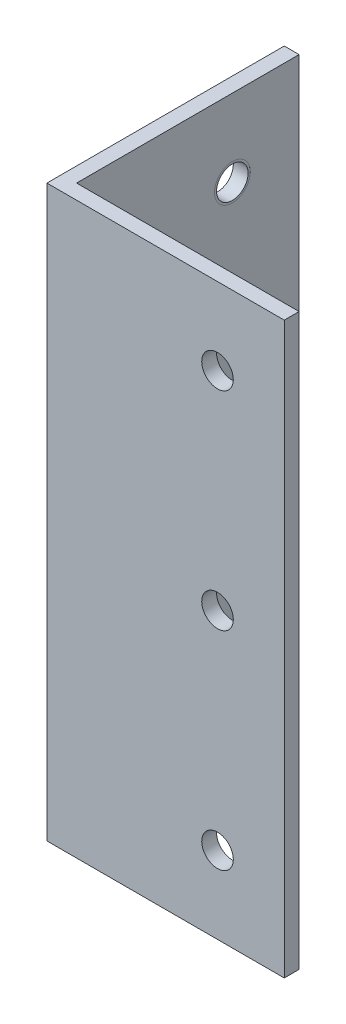
ISO-10303-21;
HEADER;
FILE_DESCRIPTION(('STEP AP214'),'2;1');
FILE_NAME('part.step','',(''),(''),'','','');
FILE_SCHEMA(('AUTOMOTIVE_DESIGN { 1 0 10303 214 1 1 1 1 }'));
ENDSEC;
DATA;
#1=APPLICATION_CONTEXT('core data for automotive mechanical design processes');
#2=APPLICATION_PROTOCOL_DEFINITION('international standard','automotive_design',2000,#1);
#3=PRODUCT_CONTEXT('',#1,'mechanical');
#4=PRODUCT('Part','Part','',(#3));
#5=PRODUCT_RELATED_PRODUCT_CATEGORY('part','',(#4));
#6=PRODUCT_DEFINITION_FORMATION('','',#4);
#7=PRODUCT_DEFINITION_CONTEXT('part definition',#1,'design');
#8=PRODUCT_DEFINITION('design','',#6,#7);
#9=PRODUCT_DEFINITION_SHAPE('','',#8);
#10=(LENGTH_UNIT() NAMED_UNIT(*) SI_UNIT(.MILLI.,.METRE.));
#11=(NAMED_UNIT(*) PLANE_ANGLE_UNIT() SI_UNIT($,.RADIAN.));
#12=(NAMED_UNIT(*) SI_UNIT($,.STERADIAN.) SOLID_ANGLE_UNIT());
#13=UNCERTAINTY_MEASURE_WITH_UNIT(LENGTH_MEASURE(1.E-05),#10,'distance_accuracy_value','');
#14=(GEOMETRIC_REPRESENTATION_CONTEXT(3) GLOBAL_UNCERTAINTY_ASSIGNED_CONTEXT((#13)) GLOBAL_UNIT_ASSIGNED_CONTEXT((#10,
#11,#12)) REPRESENTATION_CONTEXT('',''));
#15=CARTESIAN_POINT('',(0.,0.,0.));
#16=DIRECTION('',(0.,0.,1.));
#17=DIRECTION('',(1.,0.,0.));
#18=AXIS2_PLACEMENT_3D('',#15,#16,#17);
#19=CARTESIAN_POINT('',(-19.051,-34.925,-14.2875));
#20=DIRECTION('',(-1.,0.,0.));
#21=DIRECTION('',(0.,0.,1.));
#22=AXIS2_PLACEMENT_3D('',#19,#20,#21);
#23=PLANE('',#22);
#24=CARTESIAN_POINT('',(-19.051,-34.925,-14.2875));
#25=DIRECTION('',(1.,0.,0.));
#26=DIRECTION('',(0.,0.,-1.));
#27=AXIS2_PLACEMENT_3D('',#24,#25,#26);
#28=CIRCLE('',#27,3.8354);
#29=CARTESIAN_POINT('',(-19.051,-34.925,-18.1229));
#30=VERTEX_POINT('',#29);
#31=EDGE_CURVE('E154',#30,#30,#28,.T.);
#32=ORIENTED_EDGE('',*,*,#31,.T.);
#33=EDGE_LOOP('',(#32));
#34=FACE_BOUND('',#33,.T.);
#35=CARTESIAN_POINT('',(-19.051,-34.925,-14.2875));
#36=DIRECTION('',(1.,0.,0.));
#37=DIRECTION('',(0.,0.,-1.));
#38=AXIS2_PLACEMENT_3D('',#35,#36,#37);
#39=CIRCLE('',#38,3.3782);
#40=CARTESIAN_POINT('',(-19.051,-34.925,-17.6657));
#41=VERTEX_POINT('',#40);
#42=EDGE_CURVE('E469',#41,#41,#39,.T.);
#43=ORIENTED_EDGE('',*,*,#42,.F.);
#44=EDGE_LOOP('',(#43));
#45=FACE_BOUND('',#44,.T.);
#46=ADVANCED_FACE('F36',(#34,#45),#23,.F.);
#47=CARTESIAN_POINT('',(14.2875,9.52499999999999,19.051));
#48=DIRECTION('',(0.,0.,1.));
#49=DIRECTION('',(1.,0.,0.));
#50=AXIS2_PLACEMENT_3D('',#47,#48,#49);
#51=PLANE('',#50);
#52=CARTESIAN_POINT('',(14.2875,9.52499999999999,19.051));
#53=DIRECTION('',(0.,0.,-1.));
#54=DIRECTION('',(-1.,0.,0.));
#55=AXIS2_PLACEMENT_3D('',#52,#53,#54);
#56=CIRCLE('',#55,3.8354);
#57=CARTESIAN_POINT('',(10.4521,9.52499999999999,19.051));
#58=VERTEX_POINT('',#57);
#59=EDGE_CURVE('E139',#58,#58,#56,.T.);
#60=ORIENTED_EDGE('',*,*,#59,.T.);
#61=EDGE_LOOP('',(#60));
#62=FACE_BOUND('',#61,.T.);
#63=CARTESIAN_POINT('',(14.2875,9.52499999999999,19.051));
#64=DIRECTION('',(0.,0.,-1.));
#65=DIRECTION('',(-1.,0.,0.));
#66=AXIS2_PLACEMENT_3D('',#63,#64,#65);
#67=CIRCLE('',#66,3.3782);
#68=CARTESIAN_POINT('',(10.9093,9.52499999999999,19.051));
#69=VERTEX_POINT('',#68);
#70=EDGE_CURVE('E173',#69,#69,#67,.T.);
#71=ORIENTED_EDGE('',*,*,#70,.F.);
#72=EDGE_LOOP('',(#71));
#73=FACE_BOUND('',#72,.T.);
#74=ADVANCED_FACE('F223',(#62,#73),#51,.F.);
#75=CARTESIAN_POINT('',(165.1,-51.435,0.));
#76=DIRECTION('',(0.,-1.,0.));
#77=DIRECTION('',(1.,0.,0.));
#78=AXIS2_PLACEMENT_3D('',#75,#76,#77);
#79=PLANE('',#78);
#80=DIRECTION('',(0.,0.,-1.));
#81=VECTOR('',#80,1.);
#82=CARTESIAN_POINT('',(-19.05,-51.435,19.05));
#83=LINE('',#82,#81);
#84=CARTESIAN_POINT('',(-19.05,-51.435,19.05));
#85=VERTEX_POINT('',#84);
#86=CARTESIAN_POINT('',(-19.05,-51.435,-28.575));
#87=VERTEX_POINT('',#86);
#88=EDGE_CURVE('E46',#85,#87,#83,.T.);
#89=ORIENTED_EDGE('',*,*,#88,.F.);
#90=DIRECTION('',(-1.,0.,0.));
#91=VECTOR('',#90,1.);
#92=CARTESIAN_POINT('',(28.575,-51.435,19.05));
#93=LINE('',#92,#91);
#94=CARTESIAN_POINT('',(28.575,-51.435,19.05));
#95=VERTEX_POINT('',#94);
#96=EDGE_CURVE('E123',#95,#85,#93,.T.);
#97=ORIENTED_EDGE('',*,*,#96,.F.);
#98=DIRECTION('',(0.,0.,-1.));
#99=VECTOR('',#98,1.);
#100=CARTESIAN_POINT('',(28.575,-51.435,22.225));
#101=LINE('',#100,#99);
#102=CARTESIAN_POINT('',(28.575,-51.435,22.225));
#103=VERTEX_POINT('',#102);
#104=EDGE_CURVE('E127',#103,#95,#101,.T.);
#105=ORIENTED_EDGE('',*,*,#104,.F.);
#106=DIRECTION('',(1.,0.,0.));
#107=VECTOR('',#106,1.);
#108=CARTESIAN_POINT('',(-22.225,-51.435,22.225));
#109=LINE('',#108,#107);
#110=CARTESIAN_POINT('',(-22.225,-51.435,22.225));
#111=VERTEX_POINT('',#110);
#112=EDGE_CURVE('E76',#111,#103,#109,.T.);
#113=ORIENTED_EDGE('',*,*,#112,.F.);
#114=DIRECTION('',(0.,0.,1.));
#115=VECTOR('',#114,1.);
#116=CARTESIAN_POINT('',(-22.225,-51.435,-28.575));
#117=LINE('',#116,#115);
#118=CARTESIAN_POINT('',(-22.225,-51.435,-28.575));
#119=VERTEX_POINT('',#118);
#120=EDGE_CURVE('E81',#119,#111,#117,.T.);
#121=ORIENTED_EDGE('',*,*,#120,.F.);
#122=DIRECTION('',(-1.,0.,0.));
#123=VECTOR('',#122,1.);
#124=CARTESIAN_POINT('',(-19.05,-51.435,-28.575));
#125=LINE('',#124,#123);
#126=EDGE_CURVE('E102',#87,#119,#125,.T.);
#127=ORIENTED_EDGE('',*,*,#126,.F.);
#128=EDGE_LOOP('',(#89,#97,#105,#113,#121,#127));
#129=FACE_BOUND('',#128,.T.);
#130=ADVANCED_FACE('F38',(#129),#79,.T.);
#131=CARTESIAN_POINT('',(0.,70.485,0.));
#132=DIRECTION('',(0.,1.,0.));
#133=DIRECTION('',(0.,0.,1.));
#134=AXIS2_PLACEMENT_3D('',#131,#132,#133);
#135=PLANE('',#134);
#136=DIRECTION('',(0.,0.,-1.));
#137=VECTOR('',#136,1.);
#138=CARTESIAN_POINT('',(-19.05,70.485,19.05));
#139=LINE('',#138,#137);
#140=CARTESIAN_POINT('',(-19.05,70.485,19.05));
#141=VERTEX_POINT('',#140);
#142=CARTESIAN_POINT('',(-19.05,70.485,-28.575));
#143=VERTEX_POINT('',#142);
#144=EDGE_CURVE('E113',#141,#143,#139,.T.);
#145=ORIENTED_EDGE('',*,*,#144,.T.);
#146=DIRECTION('',(-1.,0.,0.));
#147=VECTOR('',#146,1.);
#148=CARTESIAN_POINT('',(-19.05,70.485,-28.575));
#149=LINE('',#148,#147);
#150=CARTESIAN_POINT('',(-22.225,70.485,-28.575));
#151=VERTEX_POINT('',#150);
#152=EDGE_CURVE('E100',#143,#151,#149,.T.);
#153=ORIENTED_EDGE('',*,*,#152,.T.);
#154=DIRECTION('',(0.,0.,1.));
#155=VECTOR('',#154,1.);
#156=CARTESIAN_POINT('',(-22.225,70.485,-28.575));
#157=LINE('',#156,#155);
#158=CARTESIAN_POINT('',(-22.225,70.485,22.225));
#159=VERTEX_POINT('',#158);
#160=EDGE_CURVE('E105',#151,#159,#157,.T.);
#161=ORIENTED_EDGE('',*,*,#160,.T.);
#162=DIRECTION('',(1.,0.,0.));
#163=VECTOR('',#162,1.);
#164=CARTESIAN_POINT('',(-22.225,70.485,22.225));
#165=LINE('',#164,#163);
#166=CARTESIAN_POINT('',(28.575,70.485,22.225));
#167=VERTEX_POINT('',#166);
#168=EDGE_CURVE('E109',#159,#167,#165,.T.);
#169=ORIENTED_EDGE('',*,*,#168,.T.);
#170=DIRECTION('',(0.,0.,-1.));
#171=VECTOR('',#170,1.);
#172=CARTESIAN_POINT('',(28.575,70.485,22.225));
#173=LINE('',#172,#171);
#174=CARTESIAN_POINT('',(28.575,70.485,19.05));
#175=VERTEX_POINT('',#174);
#176=EDGE_CURVE('E192',#167,#175,#173,.T.);
#177=ORIENTED_EDGE('',*,*,#176,.T.);
#178=DIRECTION('',(-1.,0.,0.));
#179=VECTOR('',#178,1.);
#180=CARTESIAN_POINT('',(28.575,70.485,19.05));
#181=LINE('',#180,#179);
#182=EDGE_CURVE('E120',#175,#141,#181,.T.);
#183=ORIENTED_EDGE('',*,*,#182,.T.);
#184=EDGE_LOOP('',(#145,#153,#161,#169,#177,#183));
#185=FACE_BOUND('',#184,.T.);
#186=ADVANCED_FACE('F111',(#185),#135,.T.);
#187=CARTESIAN_POINT('',(-19.05,-125.817048968553,-28.575));
#188=DIRECTION('',(0.,0.,-1.));
#189=DIRECTION('',(-1.,0.,0.));
#190=AXIS2_PLACEMENT_3D('',#187,#188,#189);
#191=PLANE('',#190);
#192=DIRECTION('',(0.,1.,0.));
#193=VECTOR('',#192,1.);
#194=CARTESIAN_POINT('',(-19.05,-125.817048968553,-28.575));
#195=LINE('',#194,#193);
#196=EDGE_CURVE('E11',#87,#143,#195,.T.);
#197=ORIENTED_EDGE('',*,*,#196,.F.);
#198=ORIENTED_EDGE('',*,*,#126,.T.);
#199=DIRECTION('',(0.,1.,0.));
#200=VECTOR('',#199,1.);
#201=CARTESIAN_POINT('',(-22.225,-125.817048968553,-28.575));
#202=LINE('',#201,#200);
#203=EDGE_CURVE('E97',#119,#151,#202,.T.);
#204=ORIENTED_EDGE('',*,*,#203,.T.);
#205=ORIENTED_EDGE('',*,*,#152,.F.);
#206=EDGE_LOOP('',(#197,#198,#204,#205));
#207=FACE_BOUND('',#206,.T.);
#208=ADVANCED_FACE('F98',(#207),#191,.T.);
#209=CARTESIAN_POINT('',(-22.225,-125.817048968553,-28.575));
#210=DIRECTION('',(-1.,0.,0.));
#211=DIRECTION('',(0.,0.,1.));
#212=AXIS2_PLACEMENT_3D('',#209,#210,#211);
#213=PLANE('',#212);
#214=CARTESIAN_POINT('',(-22.225,9.52499999999999,-14.2875));
#215=DIRECTION('',(-1.,0.,0.));
#216=DIRECTION('',(0.,0.,1.));
#217=AXIS2_PLACEMENT_3D('',#214,#215,#216);
#218=CIRCLE('',#217,3.3782);
#219=CARTESIAN_POINT('',(-22.225,9.52499999999999,-10.9093));
#220=VERTEX_POINT('',#219);
#221=EDGE_CURVE('E454',#220,#220,#218,.T.);
#222=ORIENTED_EDGE('',*,*,#221,.F.);
#223=EDGE_LOOP('',(#222));
#224=FACE_BOUND('',#223,.T.);
#225=CARTESIAN_POINT('',(-22.225,-34.925,-14.2875));
#226=DIRECTION('',(-1.,0.,0.));
#227=DIRECTION('',(0.,0.,1.));
#228=AXIS2_PLACEMENT_3D('',#225,#226,#227);
#229=CIRCLE('',#228,3.3782);
#230=CARTESIAN_POINT('',(-22.225,-34.925,-10.9093));
#231=VERTEX_POINT('',#230);
#232=EDGE_CURVE('E458',#231,#231,#229,.T.);
#233=ORIENTED_EDGE('',*,*,#232,.F.);
#234=EDGE_LOOP('',(#233));
#235=FACE_BOUND('',#234,.T.);
#236=CARTESIAN_POINT('',(-22.225,53.975,-14.2875));
#237=DIRECTION('',(-1.,0.,0.));
#238=DIRECTION('',(0.,0.,1.));
#239=AXIS2_PLACEMENT_3D('',#236,#237,#238);
#240=CIRCLE('',#239,3.3782);
#241=CARTESIAN_POINT('',(-22.225,53.975,-10.9093));
#242=VERTEX_POINT('',#241);
#243=EDGE_CURVE('E461',#242,#242,#240,.T.);
#244=ORIENTED_EDGE('',*,*,#243,.F.);
#245=EDGE_LOOP('',(#244));
#246=FACE_BOUND('',#245,.T.);
#247=ORIENTED_EDGE('',*,*,#203,.F.);
#248=ORIENTED_EDGE('',*,*,#120,.T.);
#249=DIRECTION('',(0.,1.,0.));
#250=VECTOR('',#249,1.);
#251=CARTESIAN_POINT('',(-22.225,-125.817048968553,22.225));
#252=LINE('',#251,#250);
#253=EDGE_CURVE('E92',#111,#159,#252,.T.);
#254=ORIENTED_EDGE('',*,*,#253,.T.);
#255=ORIENTED_EDGE('',*,*,#160,.F.);
#256=EDGE_LOOP('',(#247,#248,#254,#255));
#257=FACE_BOUND('',#256,.T.);
#258=ADVANCED_FACE('F106',(#224,#235,#246,#257),#213,.T.);
#259=CARTESIAN_POINT('',(-22.225,-125.817048968553,22.225));
#260=DIRECTION('',(0.,0.,1.));
#261=DIRECTION('',(1.,0.,0.));
#262=AXIS2_PLACEMENT_3D('',#259,#260,#261);
#263=PLANE('',#262);
#264=CARTESIAN_POINT('',(14.2875,53.975,22.225));
#265=DIRECTION('',(0.,0.,1.));
#266=DIRECTION('',(1.,0.,0.));
#267=AXIS2_PLACEMENT_3D('',#264,#265,#266);
#268=CIRCLE('',#267,3.3782);
#269=CARTESIAN_POINT('',(17.6657,53.975,22.225));
#270=VERTEX_POINT('',#269);
#271=EDGE_CURVE('E170',#270,#270,#268,.T.);
#272=ORIENTED_EDGE('',*,*,#271,.F.);
#273=EDGE_LOOP('',(#272));
#274=FACE_BOUND('',#273,.T.);
#275=CARTESIAN_POINT('',(14.2875,9.52499999999999,22.225));
#276=DIRECTION('',(0.,0.,1.));
#277=DIRECTION('',(1.,0.,0.));
#278=AXIS2_PLACEMENT_3D('',#275,#276,#277);
#279=CIRCLE('',#278,3.3782);
#280=CARTESIAN_POINT('',(17.6657,9.52499999999999,22.225));
#281=VERTEX_POINT('',#280);
#282=EDGE_CURVE('E176',#281,#281,#279,.T.);
#283=ORIENTED_EDGE('',*,*,#282,.F.);
#284=EDGE_LOOP('',(#283));
#285=FACE_BOUND('',#284,.T.);
#286=CARTESIAN_POINT('',(14.2875,-34.925,22.225));
#287=DIRECTION('',(0.,0.,1.));
#288=DIRECTION('',(1.,0.,0.));
#289=AXIS2_PLACEMENT_3D('',#286,#287,#288);
#290=CIRCLE('',#289,3.3782);
#291=CARTESIAN_POINT('',(17.6657,-34.925,22.225));
#292=VERTEX_POINT('',#291);
#293=EDGE_CURVE('E182',#292,#292,#290,.T.);
#294=ORIENTED_EDGE('',*,*,#293,.F.);
#295=EDGE_LOOP('',(#294));
#296=FACE_BOUND('',#295,.T.);
#297=ORIENTED_EDGE('',*,*,#253,.F.);
#298=ORIENTED_EDGE('',*,*,#112,.T.);
#299=DIRECTION('',(0.,1.,0.));
#300=VECTOR('',#299,1.);
#301=CARTESIAN_POINT('',(28.575,-125.817048968553,22.225));
#302=LINE('',#301,#300);
#303=EDGE_CURVE('E130',#103,#167,#302,.T.);
#304=ORIENTED_EDGE('',*,*,#303,.T.);
#305=ORIENTED_EDGE('',*,*,#168,.F.);
#306=EDGE_LOOP('',(#297,#298,#304,#305));
#307=FACE_BOUND('',#306,.T.);
#308=ADVANCED_FACE('F197',(#274,#285,#296,#307),#263,.T.);
#309=CARTESIAN_POINT('',(28.575,-125.817048968553,22.225));
#310=DIRECTION('',(1.,0.,0.));
#311=DIRECTION('',(0.,1.,0.));
#312=AXIS2_PLACEMENT_3D('',#309,#310,#311);
#313=PLANE('',#312);
#314=ORIENTED_EDGE('',*,*,#303,.F.);
#315=ORIENTED_EDGE('',*,*,#104,.T.);
#316=DIRECTION('',(0.,1.,0.));
#317=VECTOR('',#316,1.);
#318=CARTESIAN_POINT('',(28.575,-125.817048968553,19.05));
#319=LINE('',#318,#317);
#320=EDGE_CURVE('E126',#95,#175,#319,.T.);
#321=ORIENTED_EDGE('',*,*,#320,.T.);
#322=ORIENTED_EDGE('',*,*,#176,.F.);
#323=EDGE_LOOP('',(#314,#315,#321,#322));
#324=FACE_BOUND('',#323,.T.);
#325=ADVANCED_FACE('F200',(#324),#313,.T.);
#326=CARTESIAN_POINT('',(28.575,-125.817048968553,19.05));
#327=DIRECTION('',(0.,0.,-1.));
#328=DIRECTION('',(-1.,0.,0.));
#329=AXIS2_PLACEMENT_3D('',#326,#327,#328);
#330=PLANE('',#329);
#331=CARTESIAN_POINT('',(14.2875,53.975,19.05));
#332=DIRECTION('',(0.,0.,-1.));
#333=DIRECTION('',(-1.,0.,0.));
#334=AXIS2_PLACEMENT_3D('',#331,#332,#333);
#335=CIRCLE('',#334,3.8354);
#336=CARTESIAN_POINT('',(10.4521,53.975,19.05));
#337=VERTEX_POINT('',#336);
#338=EDGE_CURVE('E144',#337,#337,#335,.T.);
#339=ORIENTED_EDGE('',*,*,#338,.F.);
#340=EDGE_LOOP('',(#339));
#341=FACE_BOUND('',#340,.T.);
#342=CARTESIAN_POINT('',(14.2875,-34.925,19.05));
#343=DIRECTION('',(0.,0.,-1.));
#344=DIRECTION('',(-1.,0.,0.));
#345=AXIS2_PLACEMENT_3D('',#342,#343,#344);
#346=CIRCLE('',#345,3.8354);
#347=CARTESIAN_POINT('',(10.4521,-34.925,19.05));
#348=VERTEX_POINT('',#347);
#349=EDGE_CURVE('E140',#348,#348,#346,.T.);
#350=ORIENTED_EDGE('',*,*,#349,.F.);
#351=EDGE_LOOP('',(#350));
#352=FACE_BOUND('',#351,.T.);
#353=CARTESIAN_POINT('',(14.2875,9.52499999999999,19.05));
#354=DIRECTION('',(0.,0.,-1.));
#355=DIRECTION('',(-1.,0.,0.));
#356=AXIS2_PLACEMENT_3D('',#353,#354,#355);
#357=CIRCLE('',#356,3.8354);
#358=CARTESIAN_POINT('',(10.4521,9.52499999999999,19.05));
#359=VERTEX_POINT('',#358);
#360=EDGE_CURVE('E115',#359,#359,#357,.T.);
#361=ORIENTED_EDGE('',*,*,#360,.F.);
#362=EDGE_LOOP('',(#361));
#363=FACE_BOUND('',#362,.T.);
#364=ORIENTED_EDGE('',*,*,#320,.F.);
#365=ORIENTED_EDGE('',*,*,#96,.T.);
#366=DIRECTION('',(0.,1.,0.));
#367=VECTOR('',#366,1.);
#368=CARTESIAN_POINT('',(-19.05,-125.817048968553,19.05));
#369=LINE('',#368,#367);
#370=EDGE_CURVE('E122',#85,#141,#369,.T.);
#371=ORIENTED_EDGE('',*,*,#370,.T.);
#372=ORIENTED_EDGE('',*,*,#182,.F.);
#373=EDGE_LOOP('',(#364,#365,#371,#372));
#374=FACE_BOUND('',#373,.T.);
#375=ADVANCED_FACE('F203',(#341,#352,#363,#374),#330,.T.);
#376=CARTESIAN_POINT('',(-19.05,-125.817048968553,19.05));
#377=DIRECTION('',(1.,0.,0.));
#378=DIRECTION('',(0.,1.,0.));
#379=AXIS2_PLACEMENT_3D('',#376,#377,#378);
#380=PLANE('',#379);
#381=CARTESIAN_POINT('',(-19.05,53.975,-14.2875));
#382=DIRECTION('',(1.,0.,0.));
#383=DIRECTION('',(0.,1.,0.));
#384=AXIS2_PLACEMENT_3D('',#381,#382,#383);
#385=CIRCLE('',#384,3.8354);
#386=CARTESIAN_POINT('',(-19.05,57.8104,-14.2875));
#387=VERTEX_POINT('',#386);
#388=EDGE_CURVE('E40',#387,#387,#385,.T.);
#389=ORIENTED_EDGE('',*,*,#388,.F.);
#390=EDGE_LOOP('',(#389));
#391=FACE_BOUND('',#390,.T.);
#392=CARTESIAN_POINT('',(-19.05,-34.925,-14.2875));
#393=DIRECTION('',(1.,0.,0.));
#394=DIRECTION('',(0.,1.,0.));
#395=AXIS2_PLACEMENT_3D('',#392,#393,#394);
#396=CIRCLE('',#395,3.8354);
#397=CARTESIAN_POINT('',(-19.05,-31.0896,-14.2875));
#398=VERTEX_POINT('',#397);
#399=EDGE_CURVE('E152',#398,#398,#396,.T.);
#400=ORIENTED_EDGE('',*,*,#399,.F.);
#401=EDGE_LOOP('',(#400));
#402=FACE_BOUND('',#401,.T.);
#403=CARTESIAN_POINT('',(-19.05,9.52499999999999,-14.2875));
#404=DIRECTION('',(1.,0.,0.));
#405=DIRECTION('',(0.,1.,0.));
#406=AXIS2_PLACEMENT_3D('',#403,#404,#405);
#407=CIRCLE('',#406,3.8354);
#408=CARTESIAN_POINT('',(-19.05,13.3604,-14.2875));
#409=VERTEX_POINT('',#408);
#410=EDGE_CURVE('E148',#409,#409,#407,.T.);
#411=ORIENTED_EDGE('',*,*,#410,.F.);
#412=EDGE_LOOP('',(#411));
#413=FACE_BOUND('',#412,.T.);
#414=ORIENTED_EDGE('',*,*,#370,.F.);
#415=ORIENTED_EDGE('',*,*,#88,.T.);
#416=ORIENTED_EDGE('',*,*,#196,.T.);
#417=ORIENTED_EDGE('',*,*,#144,.F.);
#418=EDGE_LOOP('',(#414,#415,#416,#417));
#419=FACE_BOUND('',#418,.T.);
#420=ADVANCED_FACE('F205',(#391,#402,#413,#419),#380,.T.);
#421=CARTESIAN_POINT('',(14.2875,9.52499999999999,0.));
#422=DIRECTION('',(0.,0.,-1.));
#423=DIRECTION('',(-1.,0.,0.));
#424=AXIS2_PLACEMENT_3D('',#421,#422,#423);
#425=CYLINDRICAL_SURFACE('',#424,3.8354);
#426=ORIENTED_EDGE('',*,*,#360,.T.);
#427=EDGE_LOOP('',(#426));
#428=FACE_BOUND('',#427,.T.);
#429=ORIENTED_EDGE('',*,*,#59,.F.);
#430=EDGE_LOOP('',(#429));
#431=FACE_BOUND('',#430,.T.);
#432=ADVANCED_FACE('F207',(#428,#431),#425,.F.);
#433=CARTESIAN_POINT('',(14.2875,-34.925,19.051));
#434=DIRECTION('',(0.,0.,1.));
#435=DIRECTION('',(1.,0.,0.));
#436=AXIS2_PLACEMENT_3D('',#433,#434,#435);
#437=PLANE('',#436);
#438=CARTESIAN_POINT('',(14.2875,-34.925,19.051));
#439=DIRECTION('',(0.,0.,-1.));
#440=DIRECTION('',(-1.,0.,0.));
#441=AXIS2_PLACEMENT_3D('',#438,#439,#440);
#442=CIRCLE('',#441,3.3782);
#443=CARTESIAN_POINT('',(10.9093,-34.925,19.051));
#444=VERTEX_POINT('',#443);
#445=EDGE_CURVE('E179',#444,#444,#442,.T.);
#446=ORIENTED_EDGE('',*,*,#445,.F.);
#447=EDGE_LOOP('',(#446));
#448=FACE_BOUND('',#447,.T.);
#449=CARTESIAN_POINT('',(14.2875,-34.925,19.051));
#450=DIRECTION('',(0.,0.,-1.));
#451=DIRECTION('',(-1.,0.,0.));
#452=AXIS2_PLACEMENT_3D('',#449,#450,#451);
#453=CIRCLE('',#452,3.8354);
#454=CARTESIAN_POINT('',(10.4521,-34.925,19.051));
#455=VERTEX_POINT('',#454);
#456=EDGE_CURVE('E143',#455,#455,#453,.T.);
#457=ORIENTED_EDGE('',*,*,#456,.T.);
#458=EDGE_LOOP('',(#457));
#459=FACE_BOUND('',#458,.T.);
#460=ADVANCED_FACE('F214',(#448,#459),#437,.F.);
#461=CARTESIAN_POINT('',(14.2875,-34.925,0.));
#462=DIRECTION('',(0.,0.,-1.));
#463=DIRECTION('',(-1.,0.,0.));
#464=AXIS2_PLACEMENT_3D('',#461,#462,#463);
#465=CYLINDRICAL_SURFACE('',#464,3.8354);
#466=ORIENTED_EDGE('',*,*,#349,.T.);
#467=EDGE_LOOP('',(#466));
#468=FACE_BOUND('',#467,.T.);
#469=ORIENTED_EDGE('',*,*,#456,.F.);
#470=EDGE_LOOP('',(#469));
#471=FACE_BOUND('',#470,.T.);
#472=ADVANCED_FACE('F262',(#468,#471),#465,.F.);
#473=CARTESIAN_POINT('',(14.2875,53.975,19.051));
#474=DIRECTION('',(0.,0.,1.));
#475=DIRECTION('',(1.,0.,0.));
#476=AXIS2_PLACEMENT_3D('',#473,#474,#475);
#477=PLANE('',#476);
#478=CARTESIAN_POINT('',(14.2875,53.975,19.051));
#479=DIRECTION('',(0.,0.,-1.));
#480=DIRECTION('',(-1.,0.,0.));
#481=AXIS2_PLACEMENT_3D('',#478,#479,#480);
#482=CIRCLE('',#481,3.3782);
#483=CARTESIAN_POINT('',(10.9093,53.975,19.051));
#484=VERTEX_POINT('',#483);
#485=EDGE_CURVE('E150',#484,#484,#482,.T.);
#486=ORIENTED_EDGE('',*,*,#485,.F.);
#487=EDGE_LOOP('',(#486));
#488=FACE_BOUND('',#487,.T.);
#489=CARTESIAN_POINT('',(14.2875,53.975,19.051));
#490=DIRECTION('',(0.,0.,-1.));
#491=DIRECTION('',(-1.,0.,0.));
#492=AXIS2_PLACEMENT_3D('',#489,#490,#491);
#493=CIRCLE('',#492,3.8354);
#494=CARTESIAN_POINT('',(10.4521,53.975,19.051));
#495=VERTEX_POINT('',#494);
#496=EDGE_CURVE('E147',#495,#495,#493,.T.);
#497=ORIENTED_EDGE('',*,*,#496,.T.);
#498=EDGE_LOOP('',(#497));
#499=FACE_BOUND('',#498,.T.);
#500=ADVANCED_FACE('F258',(#488,#499),#477,.F.);
#501=CARTESIAN_POINT('',(14.2875,53.975,0.));
#502=DIRECTION('',(0.,0.,-1.));
#503=DIRECTION('',(-1.,0.,0.));
#504=AXIS2_PLACEMENT_3D('',#501,#502,#503);
#505=CYLINDRICAL_SURFACE('',#504,3.8354);
#506=ORIENTED_EDGE('',*,*,#338,.T.);
#507=EDGE_LOOP('',(#506));
#508=FACE_BOUND('',#507,.T.);
#509=ORIENTED_EDGE('',*,*,#496,.F.);
#510=EDGE_LOOP('',(#509));
#511=FACE_BOUND('',#510,.T.);
#512=ADVANCED_FACE('F254',(#508,#511),#505,.F.);
#513=CARTESIAN_POINT('',(14.2875,-34.925,19.051));
#514=DIRECTION('',(0.,0.,-1.));
#515=DIRECTION('',(-1.,0.,0.));
#516=AXIS2_PLACEMENT_3D('',#513,#514,#515);
#517=CYLINDRICAL_SURFACE('',#516,3.3782);
#518=ORIENTED_EDGE('',*,*,#445,.T.);
#519=EDGE_LOOP('',(#518));
#520=FACE_BOUND('',#519,.T.);
#521=ORIENTED_EDGE('',*,*,#293,.T.);
#522=EDGE_LOOP('',(#521));
#523=FACE_BOUND('',#522,.T.);
#524=ADVANCED_FACE('F250',(#520,#523),#517,.F.);
#525=CARTESIAN_POINT('',(14.2875,9.52499999999999,19.051));
#526=DIRECTION('',(0.,0.,-1.));
#527=DIRECTION('',(-1.,0.,0.));
#528=AXIS2_PLACEMENT_3D('',#525,#526,#527);
#529=CYLINDRICAL_SURFACE('',#528,3.3782);
#530=ORIENTED_EDGE('',*,*,#70,.T.);
#531=EDGE_LOOP('',(#530));
#532=FACE_BOUND('',#531,.T.);
#533=ORIENTED_EDGE('',*,*,#282,.T.);
#534=EDGE_LOOP('',(#533));
#535=FACE_BOUND('',#534,.T.);
#536=ADVANCED_FACE('F246',(#532,#535),#529,.F.);
#537=CARTESIAN_POINT('',(14.2875,53.975,19.051));
#538=DIRECTION('',(0.,0.,-1.));
#539=DIRECTION('',(-1.,0.,0.));
#540=AXIS2_PLACEMENT_3D('',#537,#538,#539);
#541=CYLINDRICAL_SURFACE('',#540,3.3782);
#542=ORIENTED_EDGE('',*,*,#485,.T.);
#543=EDGE_LOOP('',(#542));
#544=FACE_BOUND('',#543,.T.);
#545=ORIENTED_EDGE('',*,*,#271,.T.);
#546=EDGE_LOOP('',(#545));
#547=FACE_BOUND('',#546,.T.);
#548=ADVANCED_FACE('F242',(#544,#547),#541,.F.);
#549=CARTESIAN_POINT('',(-19.051,9.52499999999999,-14.2875));
#550=DIRECTION('',(-1.,0.,0.));
#551=DIRECTION('',(0.,0.,1.));
#552=AXIS2_PLACEMENT_3D('',#549,#550,#551);
#553=PLANE('',#552);
#554=CARTESIAN_POINT('',(-19.051,9.52499999999999,-14.2875));
#555=DIRECTION('',(1.,0.,0.));
#556=DIRECTION('',(0.,0.,-1.));
#557=AXIS2_PLACEMENT_3D('',#554,#555,#556);
#558=CIRCLE('',#557,3.3782);
#559=CARTESIAN_POINT('',(-19.051,9.52499999999999,-17.6657));
#560=VERTEX_POINT('',#559);
#561=EDGE_CURVE('E473',#560,#560,#558,.T.);
#562=ORIENTED_EDGE('',*,*,#561,.F.);
#563=EDGE_LOOP('',(#562));
#564=FACE_BOUND('',#563,.T.);
#565=CARTESIAN_POINT('',(-19.051,9.52499999999999,-14.2875));
#566=DIRECTION('',(1.,0.,0.));
#567=DIRECTION('',(0.,0.,-1.));
#568=AXIS2_PLACEMENT_3D('',#565,#566,#567);
#569=CIRCLE('',#568,3.8354);
#570=CARTESIAN_POINT('',(-19.051,9.52499999999999,-18.1229));
#571=VERTEX_POINT('',#570);
#572=EDGE_CURVE('E151',#571,#571,#569,.T.);
#573=ORIENTED_EDGE('',*,*,#572,.T.);
#574=EDGE_LOOP('',(#573));
#575=FACE_BOUND('',#574,.T.);
#576=ADVANCED_FACE('F238',(#564,#575),#553,.F.);
#577=CARTESIAN_POINT('',(0.,9.52499999999999,-14.2875));
#578=DIRECTION('',(1.,0.,0.));
#579=DIRECTION('',(0.,0.,-1.));
#580=AXIS2_PLACEMENT_3D('',#577,#578,#579);
#581=CYLINDRICAL_SURFACE('',#580,3.8354);
#582=ORIENTED_EDGE('',*,*,#410,.T.);
#583=EDGE_LOOP('',(#582));
#584=FACE_BOUND('',#583,.T.);
#585=ORIENTED_EDGE('',*,*,#572,.F.);
#586=EDGE_LOOP('',(#585));
#587=FACE_BOUND('',#586,.T.);
#588=ADVANCED_FACE('F235',(#584,#587),#581,.F.);
#589=CARTESIAN_POINT('',(0.,-34.925,-14.2875));
#590=DIRECTION('',(1.,0.,0.));
#591=DIRECTION('',(0.,0.,-1.));
#592=AXIS2_PLACEMENT_3D('',#589,#590,#591);
#593=CYLINDRICAL_SURFACE('',#592,3.8354);
#594=ORIENTED_EDGE('',*,*,#399,.T.);
#595=EDGE_LOOP('',(#594));
#596=FACE_BOUND('',#595,.T.);
#597=ORIENTED_EDGE('',*,*,#31,.F.);
#598=EDGE_LOOP('',(#597));
#599=FACE_BOUND('',#598,.T.);
#600=ADVANCED_FACE('F233',(#596,#599),#593,.F.);
#601=CARTESIAN_POINT('',(-19.051,53.975,-14.2875));
#602=DIRECTION('',(-1.,0.,0.));
#603=DIRECTION('',(0.,0.,1.));
#604=AXIS2_PLACEMENT_3D('',#601,#602,#603);
#605=PLANE('',#604);
#606=CARTESIAN_POINT('',(-19.051,53.975,-14.2875));
#607=DIRECTION('',(1.,0.,0.));
#608=DIRECTION('',(0.,0.,-1.));
#609=AXIS2_PLACEMENT_3D('',#606,#607,#608);
#610=CIRCLE('',#609,3.3782);
#611=CARTESIAN_POINT('',(-19.051,53.975,-17.6657));
#612=VERTEX_POINT('',#611);
#613=EDGE_CURVE('E463',#612,#612,#610,.T.);
#614=ORIENTED_EDGE('',*,*,#613,.F.);
#615=EDGE_LOOP('',(#614));
#616=FACE_BOUND('',#615,.T.);
#617=CARTESIAN_POINT('',(-19.051,53.975,-14.2875));
#618=DIRECTION('',(1.,0.,0.));
#619=DIRECTION('',(0.,0.,-1.));
#620=AXIS2_PLACEMENT_3D('',#617,#618,#619);
#621=CIRCLE('',#620,3.8354);
#622=CARTESIAN_POINT('',(-19.051,53.975,-18.1229));
#623=VERTEX_POINT('',#622);
#624=EDGE_CURVE('E164',#623,#623,#621,.T.);
#625=ORIENTED_EDGE('',*,*,#624,.T.);
#626=EDGE_LOOP('',(#625));
#627=FACE_BOUND('',#626,.T.);
#628=ADVANCED_FACE('F366',(#616,#627),#605,.F.);
#629=CARTESIAN_POINT('',(0.,53.975,-14.2875));
#630=DIRECTION('',(1.,0.,0.));
#631=DIRECTION('',(0.,0.,-1.));
#632=AXIS2_PLACEMENT_3D('',#629,#630,#631);
#633=CYLINDRICAL_SURFACE('',#632,3.8354);
#634=ORIENTED_EDGE('',*,*,#388,.T.);
#635=EDGE_LOOP('',(#634));
#636=FACE_BOUND('',#635,.T.);
#637=ORIENTED_EDGE('',*,*,#624,.F.);
#638=EDGE_LOOP('',(#637));
#639=FACE_BOUND('',#638,.T.);
#640=ADVANCED_FACE('F376',(#636,#639),#633,.F.);
#641=CARTESIAN_POINT('',(-19.051,53.975,-14.2875));
#642=DIRECTION('',(1.,0.,0.));
#643=DIRECTION('',(0.,0.,-1.));
#644=AXIS2_PLACEMENT_3D('',#641,#642,#643);
#645=CYLINDRICAL_SURFACE('',#644,3.3782);
#646=ORIENTED_EDGE('',*,*,#613,.T.);
#647=EDGE_LOOP('',(#646));
#648=FACE_BOUND('',#647,.T.);
#649=ORIENTED_EDGE('',*,*,#243,.T.);
#650=EDGE_LOOP('',(#649));
#651=FACE_BOUND('',#650,.T.);
#652=ADVANCED_FACE('F386',(#648,#651),#645,.F.);
#653=CARTESIAN_POINT('',(-19.051,-34.925,-14.2875));
#654=DIRECTION('',(1.,0.,0.));
#655=DIRECTION('',(0.,0.,-1.));
#656=AXIS2_PLACEMENT_3D('',#653,#654,#655);
#657=CYLINDRICAL_SURFACE('',#656,3.3782);
#658=ORIENTED_EDGE('',*,*,#42,.T.);
#659=EDGE_LOOP('',(#658));
#660=FACE_BOUND('',#659,.T.);
#661=ORIENTED_EDGE('',*,*,#232,.T.);
#662=EDGE_LOOP('',(#661));
#663=FACE_BOUND('',#662,.T.);
#664=ADVANCED_FACE('F395',(#660,#663),#657,.F.);
#665=CARTESIAN_POINT('',(-19.051,9.52499999999999,-14.2875));
#666=DIRECTION('',(1.,0.,0.));
#667=DIRECTION('',(0.,0.,-1.));
#668=AXIS2_PLACEMENT_3D('',#665,#666,#667);
#669=CYLINDRICAL_SURFACE('',#668,3.3782);
#670=ORIENTED_EDGE('',*,*,#561,.T.);
#671=EDGE_LOOP('',(#670));
#672=FACE_BOUND('',#671,.T.);
#673=ORIENTED_EDGE('',*,*,#221,.T.);
#674=EDGE_LOOP('',(#673));
#675=FACE_BOUND('',#674,.T.);
#676=ADVANCED_FACE('F405',(#672,#675),#669,.F.);
#677=CLOSED_SHELL('',(#46,#74,#130,#186,#208,#258,#308,#325,#375,#420,#432,#460,#472,#500,#512,
#524,#536,#548,#576,#588,#600,#628,#640,#652,#664,#676));
#678=MANIFOLD_SOLID_BREP('B2',#677);
#679=ADVANCED_BREP_SHAPE_REPRESENTATION('',(#18,#678),#14);
#680=SHAPE_DEFINITION_REPRESENTATION(#9,#679);
ENDSEC;
END-ISO-10303-21;
